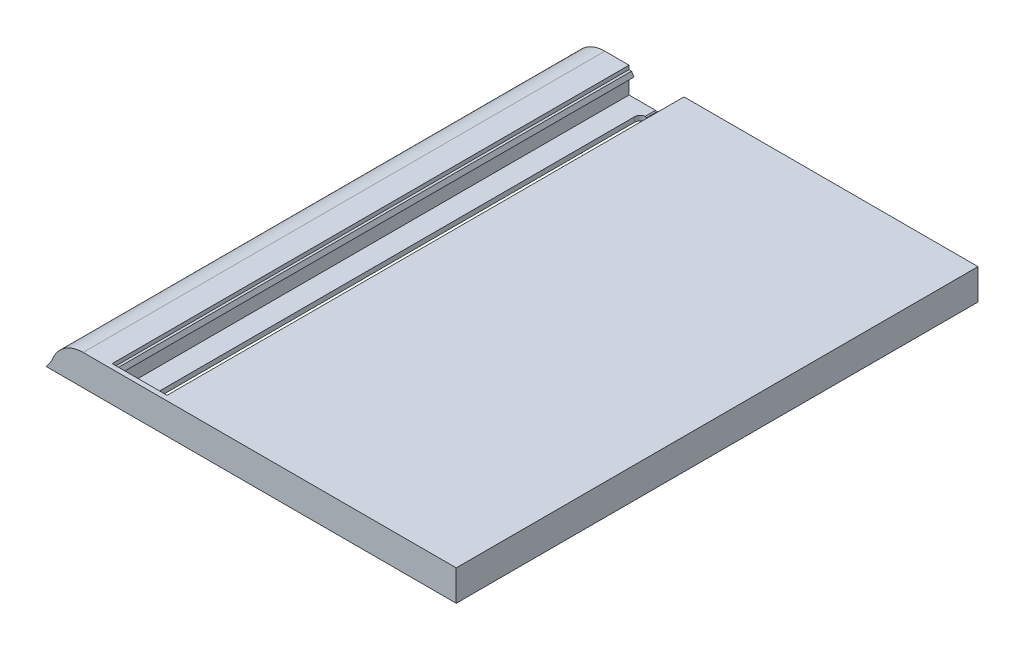
ISO-10303-21;
HEADER;
FILE_DESCRIPTION(('STEP AP214'),'2;1');
FILE_NAME('part.step','',(''),(''),'','','');
FILE_SCHEMA(('AUTOMOTIVE_DESIGN { 1 0 10303 214 1 1 1 1 }'));
ENDSEC;
DATA;
#1=APPLICATION_CONTEXT('core data for automotive mechanical design processes');
#2=APPLICATION_PROTOCOL_DEFINITION('international standard','automotive_design',2000,#1);
#3=PRODUCT_CONTEXT('',#1,'mechanical');
#4=PRODUCT('Part','Part','',(#3));
#5=PRODUCT_RELATED_PRODUCT_CATEGORY('part','',(#4));
#6=PRODUCT_DEFINITION_FORMATION('','',#4);
#7=PRODUCT_DEFINITION_CONTEXT('part definition',#1,'design');
#8=PRODUCT_DEFINITION('design','',#6,#7);
#9=PRODUCT_DEFINITION_SHAPE('','',#8);
#10=(LENGTH_UNIT() NAMED_UNIT(*) SI_UNIT(.MILLI.,.METRE.));
#11=(NAMED_UNIT(*) PLANE_ANGLE_UNIT() SI_UNIT($,.RADIAN.));
#12=(NAMED_UNIT(*) SI_UNIT($,.STERADIAN.) SOLID_ANGLE_UNIT());
#13=UNCERTAINTY_MEASURE_WITH_UNIT(LENGTH_MEASURE(1.E-05),#10,'distance_accuracy_value','');
#14=(GEOMETRIC_REPRESENTATION_CONTEXT(3) GLOBAL_UNCERTAINTY_ASSIGNED_CONTEXT((#13)) GLOBAL_UNIT_ASSIGNED_CONTEXT((#10,
#11,#12)) REPRESENTATION_CONTEXT('',''));
#15=CARTESIAN_POINT('',(0.,0.,0.));
#16=DIRECTION('',(0.,0.,1.));
#17=DIRECTION('',(1.,0.,0.));
#18=AXIS2_PLACEMENT_3D('',#15,#16,#17);
#19=CARTESIAN_POINT('',(-66.6999999999992,102.,100.67082039325));
#20=DIRECTION('',(0.707106781186531,-0.707106781186564,0.));
#21=DIRECTION('',(0.707106781186564,0.707106781186531,0.));
#22=AXIS2_PLACEMENT_3D('',#19,#20,#21);
#23=PLANE('',#22);
#24=DIRECTION('',(0.,0.,-1.));
#25=VECTOR('',#24,1.);
#26=CARTESIAN_POINT('',(-66.9999999999992,101.7,100.67082039325));
#27=LINE('',#26,#25);
#28=CARTESIAN_POINT('',(-66.9999999999992,101.7,-56.8249999999984));
#29=VERTEX_POINT('',#28);
#30=CARTESIAN_POINT('',(-66.9999999999992,101.7,-59.9999999999999));
#31=VERTEX_POINT('',#30);
#32=EDGE_CURVE('E401',#29,#31,#27,.T.);
#33=ORIENTED_EDGE('',*,*,#32,.F.);
#34=CARTESIAN_POINT('',(-67.0000000000015,101.699999999997,-55.));
#35=DIRECTION('',(0.707106781186531,-0.707106781186564,0.));
#36=DIRECTION('',(0.707106781186564,0.707106781186531,0.));
#37=AXIS2_PLACEMENT_3D('',#34,#35,#36);
#38=ELLIPSE('',#37,2.5809397513287,1.82499999999849);
#39=CARTESIAN_POINT('',(-66.6999999999992,102.,-56.8001736027375));
#40=VERTEX_POINT('',#39);
#41=EDGE_CURVE('E294',#29,#40,#38,.T.);
#42=ORIENTED_EDGE('',*,*,#41,.T.);
#43=DIRECTION('',(0.,0.,-1.));
#44=VECTOR('',#43,1.);
#45=CARTESIAN_POINT('',(-66.6999999999992,102.,100.67082039325));
#46=LINE('',#45,#44);
#47=CARTESIAN_POINT('',(-66.6999999999992,102.,-59.9999999999999));
#48=VERTEX_POINT('',#47);
#49=EDGE_CURVE('E408',#40,#48,#46,.T.);
#50=ORIENTED_EDGE('',*,*,#49,.T.);
#51=DIRECTION('',(-0.707106781186564,-0.707106781186531,0.));
#52=VECTOR('',#51,1.);
#53=CARTESIAN_POINT('',(-84.3499999999979,84.3500000000017,-60.));
#54=LINE('',#53,#52);
#55=EDGE_CURVE('E417',#48,#31,#54,.T.);
#56=ORIENTED_EDGE('',*,*,#55,.T.);
#57=EDGE_LOOP('',(#33,#42,#50,#56));
#58=FACE_BOUND('',#57,.T.);
#59=ADVANCED_FACE('F33',(#58),#23,.F.);
#60=CARTESIAN_POINT('',(-66.9999999999992,101.7,100.67082039325));
#61=DIRECTION('',(-0.707106781186531,-0.707106781186564,0.));
#62=DIRECTION('',(0.707106781186564,-0.707106781186531,0.));
#63=AXIS2_PLACEMENT_3D('',#60,#61,#62);
#64=PLANE('',#63);
#65=DIRECTION('',(0.,0.,-1.));
#66=VECTOR('',#65,1.);
#67=CARTESIAN_POINT('',(-67.2999999999992,102.,100.67082039325));
#68=LINE('',#67,#66);
#69=CARTESIAN_POINT('',(-67.2999999999992,102.,-56.8001736027382));
#70=VERTEX_POINT('',#69);
#71=CARTESIAN_POINT('',(-67.2999999999995,102.,-60.));
#72=VERTEX_POINT('',#71);
#73=EDGE_CURVE('E405',#70,#72,#68,.T.);
#74=ORIENTED_EDGE('',*,*,#73,.F.);
#75=CARTESIAN_POINT('',(-67.0000000000015,101.700000000002,-55.));
#76=DIRECTION('',(-0.707106781186531,-0.707106781186564,0.));
#77=DIRECTION('',(-0.707106781186564,0.707106781186531,0.));
#78=AXIS2_PLACEMENT_3D('',#75,#76,#77);
#79=ELLIPSE('',#78,2.58093975132872,1.82499999999849);
#80=EDGE_CURVE('E523',#70,#29,#79,.T.);
#81=ORIENTED_EDGE('',*,*,#80,.T.);
#82=ORIENTED_EDGE('',*,*,#32,.T.);
#83=DIRECTION('',(-0.707106781186564,0.707106781186531,0.));
#84=VECTOR('',#83,1.);
#85=CARTESIAN_POINT('',(17.3500000000018,17.3500000000026,-60.));
#86=LINE('',#85,#84);
#87=EDGE_CURVE('E414',#31,#72,#86,.T.);
#88=ORIENTED_EDGE('',*,*,#87,.T.);
#89=EDGE_LOOP('',(#74,#81,#82,#88));
#90=FACE_BOUND('',#89,.T.);
#91=ADVANCED_FACE('F553',(#90),#64,.F.);
#92=CARTESIAN_POINT('',(31.,102.,80.));
#93=DIRECTION('',(0.,1.,0.));
#94=DIRECTION('',(0.,0.,1.));
#95=AXIS2_PLACEMENT_3D('',#92,#93,#94);
#96=PLANE('',#95);
#97=CARTESIAN_POINT('',(-67.0000000000015,102.,-55.));
#98=DIRECTION('',(0.,1.,0.));
#99=DIRECTION('',(0.,0.,1.));
#100=AXIS2_PLACEMENT_3D('',#97,#98,#99);
#101=CIRCLE('',#100,1.82499999999849);
#102=CARTESIAN_POINT('',(-65.1750000000015,102.,-55.));
#103=VERTEX_POINT('',#102);
#104=EDGE_CURVE('E299',#103,#40,#101,.T.);
#105=ORIENTED_EDGE('',*,*,#104,.F.);
#106=DIRECTION('',(1.12502599828685E-13,0.,-1.));
#107=VECTOR('',#106,1.);
#108=CARTESIAN_POINT('',(-65.1750000000167,102.,79.9999999999892));
#109=LINE('',#108,#107);
#110=CARTESIAN_POINT('',(-65.1750000000184,102.,94.9999999999969));
#111=VERTEX_POINT('',#110);
#112=EDGE_CURVE('E270',#111,#103,#109,.T.);
#113=ORIENTED_EDGE('',*,*,#112,.F.);
#114=CARTESIAN_POINT('',(-67.0000000000015,102.,95.));
#115=DIRECTION('',(0.,1.,0.));
#116=DIRECTION('',(0.,0.,1.));
#117=AXIS2_PLACEMENT_3D('',#114,#115,#116);
#118=CIRCLE('',#117,1.82499999999999);
#119=CARTESIAN_POINT('',(-66.6999999999992,102.,96.8001736027391));
#120=VERTEX_POINT('',#119);
#121=EDGE_CURVE('E284',#120,#111,#118,.T.);
#122=ORIENTED_EDGE('',*,*,#121,.F.);
#123=CARTESIAN_POINT('',(-66.6999999999992,102.,100.));
#124=VERTEX_POINT('',#123);
#125=EDGE_CURVE('E411',#124,#120,#46,.T.);
#126=ORIENTED_EDGE('',*,*,#125,.F.);
#127=DIRECTION('',(-1.,0.,0.));
#128=VECTOR('',#127,1.);
#129=CARTESIAN_POINT('',(31.,102.,100.));
#130=LINE('',#129,#128);
#131=CARTESIAN_POINT('',(-58.4999999999992,102.,100.));
#132=VERTEX_POINT('',#131);
#133=EDGE_CURVE('E465',#132,#124,#130,.T.);
#134=ORIENTED_EDGE('',*,*,#133,.F.);
#135=DIRECTION('',(0.,0.,-1.));
#136=VECTOR('',#135,1.);
#137=CARTESIAN_POINT('',(-58.4999999999992,102.,121.691011963485));
#138=LINE('',#137,#136);
#139=CARTESIAN_POINT('',(-58.4999999999992,102.,-60.));
#140=VERTEX_POINT('',#139);
#141=EDGE_CURVE('E341',#132,#140,#138,.T.);
#142=ORIENTED_EDGE('',*,*,#141,.T.);
#143=DIRECTION('',(-1.,0.,0.));
#144=VECTOR('',#143,1.);
#145=CARTESIAN_POINT('',(31.,102.,-60.));
#146=LINE('',#145,#144);
#147=EDGE_CURVE('E424',#140,#48,#146,.T.);
#148=ORIENTED_EDGE('',*,*,#147,.T.);
#149=ORIENTED_EDGE('',*,*,#49,.F.);
#150=EDGE_LOOP('',(#105,#113,#122,#126,#134,#142,#148,#149));
#151=FACE_BOUND('',#150,.T.);
#152=ADVANCED_FACE('F544',(#151),#96,.T.);
#153=CARTESIAN_POINT('',(-101.758107565017,107.555793957317,100.));
#154=DIRECTION('',(0.,0.,-1.));
#155=DIRECTION('',(-1.,0.,0.));
#156=AXIS2_PLACEMENT_3D('',#153,#154,#155);
#157=PLANE('',#156);
#158=DIRECTION('',(-0.5,-0.866025403784439,0.));
#159=VECTOR('',#158,1.);
#160=CARTESIAN_POINT('',(-59.2783121635121,108.8,100.));
#161=LINE('',#160,#159);
#162=CARTESIAN_POINT('',(-59.2783121635121,108.8,100.));
#163=VERTEX_POINT('',#162);
#164=CARTESIAN_POINT('',(-59.9999999999991,107.55,100.));
#165=VERTEX_POINT('',#164);
#166=EDGE_CURVE('E381',#163,#165,#161,.T.);
#167=ORIENTED_EDGE('',*,*,#166,.T.);
#168=DIRECTION('',(1.,0.,0.));
#169=VECTOR('',#168,1.);
#170=CARTESIAN_POINT('',(-58.4999999999991,107.55,100.));
#171=LINE('',#170,#169);
#172=CARTESIAN_POINT('',(-58.4999999999991,107.55,100.));
#173=VERTEX_POINT('',#172);
#174=EDGE_CURVE('E316',#165,#173,#171,.T.);
#175=ORIENTED_EDGE('',*,*,#174,.T.);
#176=DIRECTION('',(0.,-1.,0.));
#177=VECTOR('',#176,1.);
#178=CARTESIAN_POINT('',(-58.4999999999992,102.,100.));
#179=LINE('',#178,#177);
#180=EDGE_CURVE('E314',#173,#132,#179,.T.);
#181=ORIENTED_EDGE('',*,*,#180,.T.);
#182=ORIENTED_EDGE('',*,*,#133,.T.);
#183=DIRECTION('',(-0.707106781186564,-0.707106781186531,0.));
#184=VECTOR('',#183,1.);
#185=CARTESIAN_POINT('',(-66.6999999999992,102.,100.));
#186=LINE('',#185,#184);
#187=CARTESIAN_POINT('',(-66.9999999999992,101.7,100.));
#188=VERTEX_POINT('',#187);
#189=EDGE_CURVE('E398',#124,#188,#186,.T.);
#190=ORIENTED_EDGE('',*,*,#189,.T.);
#191=DIRECTION('',(-0.707106781186564,0.707106781186531,0.));
#192=VECTOR('',#191,1.);
#193=CARTESIAN_POINT('',(-66.9999999999992,101.7,100.));
#194=LINE('',#193,#192);
#195=CARTESIAN_POINT('',(-67.2999999999992,102.,100.));
#196=VERTEX_POINT('',#195);
#197=EDGE_CURVE('E402',#188,#196,#194,.T.);
#198=ORIENTED_EDGE('',*,*,#197,.T.);
#199=CARTESIAN_POINT('',(-75.4999999999991,102.,100.));
#200=VERTEX_POINT('',#199);
#201=EDGE_CURVE('E466',#196,#200,#130,.T.);
#202=ORIENTED_EDGE('',*,*,#201,.T.);
#203=DIRECTION('',(0.,1.,0.));
#204=VECTOR('',#203,1.);
#205=CARTESIAN_POINT('',(-75.4999999999991,107.55,100.));
#206=LINE('',#205,#204);
#207=CARTESIAN_POINT('',(-75.4999999999991,107.55,100.));
#208=VERTEX_POINT('',#207);
#209=EDGE_CURVE('E312',#200,#208,#206,.T.);
#210=ORIENTED_EDGE('',*,*,#209,.T.);
#211=DIRECTION('',(1.,0.,0.));
#212=VECTOR('',#211,1.);
#213=CARTESIAN_POINT('',(-73.9999999999991,107.55,100.));
#214=LINE('',#213,#212);
#215=CARTESIAN_POINT('',(-73.9999999999991,107.55,100.));
#216=VERTEX_POINT('',#215);
#217=EDGE_CURVE('E309',#208,#216,#214,.T.);
#218=ORIENTED_EDGE('',*,*,#217,.T.);
#219=DIRECTION('',(-0.499999999999998,0.86602540378444,0.));
#220=VECTOR('',#219,1.);
#221=CARTESIAN_POINT('',(-73.5669872981068,106.8,100.));
#222=LINE('',#221,#220);
#223=CARTESIAN_POINT('',(-74.7216878364861,108.8,100.));
#224=VERTEX_POINT('',#223);
#225=EDGE_CURVE('E379',#216,#224,#222,.T.);
#226=ORIENTED_EDGE('',*,*,#225,.T.);
#227=DIRECTION('',(-1.,0.,0.));
#228=VECTOR('',#227,1.);
#229=CARTESIAN_POINT('',(-74.7216878364861,108.8,100.));
#230=LINE('',#229,#228);
#231=CARTESIAN_POINT('',(-75.4999999999991,108.8,100.));
#232=VERTEX_POINT('',#231);
#233=EDGE_CURVE('E375',#224,#232,#230,.T.);
#234=ORIENTED_EDGE('',*,*,#233,.T.);
#235=DIRECTION('',(0.,1.,0.));
#236=VECTOR('',#235,1.);
#237=CARTESIAN_POINT('',(-75.4999999999991,110.,100.));
#238=LINE('',#237,#236);
#239=CARTESIAN_POINT('',(-75.4999999999991,110.,100.));
#240=VERTEX_POINT('',#239);
#241=EDGE_CURVE('E371',#232,#240,#238,.T.);
#242=ORIENTED_EDGE('',*,*,#241,.T.);
#243=DIRECTION('',(1.,0.,0.));
#244=VECTOR('',#243,1.);
#245=CARTESIAN_POINT('',(-58.4999999999991,110.,100.));
#246=LINE('',#245,#244);
#247=CARTESIAN_POINT('',(-58.4999999999991,110.,100.));
#248=VERTEX_POINT('',#247);
#249=EDGE_CURVE('E367',#240,#248,#246,.T.);
#250=ORIENTED_EDGE('',*,*,#249,.T.);
#251=DIRECTION('',(0.,-1.,0.));
#252=VECTOR('',#251,1.);
#253=CARTESIAN_POINT('',(-58.4999999999991,110.,100.));
#254=LINE('',#253,#252);
#255=CARTESIAN_POINT('',(-58.4999999999991,108.8,100.));
#256=VERTEX_POINT('',#255);
#257=EDGE_CURVE('E362',#248,#256,#254,.T.);
#258=ORIENTED_EDGE('',*,*,#257,.T.);
#259=DIRECTION('',(-1.,-2.13967430422916E-13,0.));
#260=VECTOR('',#259,1.);
#261=CARTESIAN_POINT('',(-58.4999999999991,108.8,100.));
#262=LINE('',#261,#260);
#263=EDGE_CURVE('E358',#256,#163,#262,.T.);
#264=ORIENTED_EDGE('',*,*,#263,.T.);
#265=EDGE_LOOP('',(#167,#175,#181,#182,#190,#198,#202,#210,#218,#226,#234,#242,#250,#258,#264));
#266=FACE_BOUND('',#265,.T.);
#267=ADVANCED_FACE('F570',(#266),#157,.T.);
#268=DIRECTION('',(0.,-1.,0.));
#269=VECTOR('',#268,1.);
#270=CARTESIAN_POINT('',(-76.7499999999992,100.5,100.));
#271=LINE('',#270,#269);
#272=CARTESIAN_POINT('',(-76.75,108.5,100.));
#273=VERTEX_POINT('',#272);
#274=CARTESIAN_POINT('',(-76.75,102.,100.));
#275=VERTEX_POINT('',#274);
#276=EDGE_CURVE('E306',#273,#275,#271,.T.);
#277=ORIENTED_EDGE('',*,*,#276,.T.);
#278=CARTESIAN_POINT('',(-91.5328115921767,102.,100.));
#279=VERTEX_POINT('',#278);
#280=EDGE_CURVE('E461',#275,#279,#130,.T.);
#281=ORIENTED_EDGE('',*,*,#280,.T.);
#282=CARTESIAN_POINT('',(-101.758107565017,107.555793957317,100.));
#283=DIRECTION('',(0.,0.,1.));
#284=DIRECTION('',(-1.,0.,0.));
#285=AXIS2_PLACEMENT_3D('',#282,#283,#284);
#286=CIRCLE('',#285,11.6371613475259);
#287=CARTESIAN_POINT('',(-90.9912312756488,103.14015139957,100.));
#288=VERTEX_POINT('',#287);
#289=EDGE_CURVE('E464',#279,#288,#286,.T.);
#290=ORIENTED_EDGE('',*,*,#289,.T.);
#291=CARTESIAN_POINT('',(-83.,99.8628386524749,100.));
#292=DIRECTION('',(0.,0.,-1.));
#293=DIRECTION('',(-1.,0.,0.));
#294=AXIS2_PLACEMENT_3D('',#291,#292,#293);
#295=CIRCLE('',#294,8.63716134752511);
#296=CARTESIAN_POINT('',(-83.,108.5,100.));
#297=VERTEX_POINT('',#296);
#298=EDGE_CURVE('E451',#288,#297,#295,.T.);
#299=ORIENTED_EDGE('',*,*,#298,.T.);
#300=DIRECTION('',(1.,0.,0.));
#301=VECTOR('',#300,1.);
#302=CARTESIAN_POINT('',(-83.,108.5,100.));
#303=LINE('',#302,#301);
#304=EDGE_CURVE('E455',#297,#273,#303,.T.);
#305=ORIENTED_EDGE('',*,*,#304,.T.);
#306=EDGE_LOOP('',(#277,#281,#290,#299,#305));
#307=FACE_BOUND('',#306,.T.);
#308=ADVANCED_FACE('F574',(#307),#157,.T.);
#309=CARTESIAN_POINT('',(-67.0000000000015,102.,-55.));
#310=DIRECTION('',(0.,1.,0.));
#311=DIRECTION('',(0.,0.,1.));
#312=AXIS2_PLACEMENT_3D('',#309,#310,#311);
#313=CIRCLE('',#312,1.82499999999849);
#314=CARTESIAN_POINT('',(-68.8249999999985,102.,-55.));
#315=VERTEX_POINT('',#314);
#316=EDGE_CURVE('E297',#70,#315,#313,.T.);
#317=ORIENTED_EDGE('',*,*,#316,.F.);
#318=ORIENTED_EDGE('',*,*,#73,.T.);
#319=CARTESIAN_POINT('',(-75.4999999999991,102.,-60.));
#320=VERTEX_POINT('',#319);
#321=EDGE_CURVE('E425',#72,#320,#146,.T.);
#322=ORIENTED_EDGE('',*,*,#321,.T.);
#323=DIRECTION('',(0.,0.,-1.));
#324=VECTOR('',#323,1.);
#325=CARTESIAN_POINT('',(-75.4999999999992,102.,121.691011963485));
#326=LINE('',#325,#324);
#327=EDGE_CURVE('E343',#200,#320,#326,.T.);
#328=ORIENTED_EDGE('',*,*,#327,.F.);
#329=ORIENTED_EDGE('',*,*,#201,.F.);
#330=CARTESIAN_POINT('',(-67.2999999999992,102.,96.8001736027399));
#331=VERTEX_POINT('',#330);
#332=EDGE_CURVE('E283',#196,#331,#68,.T.);
#333=ORIENTED_EDGE('',*,*,#332,.T.);
#334=CARTESIAN_POINT('',(-67.0000000000015,102.,95.));
#335=DIRECTION('',(0.,1.,0.));
#336=DIRECTION('',(0.,0.,1.));
#337=AXIS2_PLACEMENT_3D('',#334,#335,#336);
#338=CIRCLE('',#337,1.82499999999999);
#339=CARTESIAN_POINT('',(-68.8250000000015,102.,94.9999999999967));
#340=VERTEX_POINT('',#339);
#341=EDGE_CURVE('E55',#340,#331,#338,.T.);
#342=ORIENTED_EDGE('',*,*,#341,.F.);
#343=DIRECTION('',(-1.32486614271938E-13,0.,1.));
#344=VECTOR('',#343,1.);
#345=CARTESIAN_POINT('',(-68.8250000000164,102.,79.9999999999868));
#346=LINE('',#345,#344);
#347=EDGE_CURVE('E264',#315,#340,#346,.T.);
#348=ORIENTED_EDGE('',*,*,#347,.F.);
#349=EDGE_LOOP('',(#317,#318,#322,#328,#329,#333,#342,#348));
#350=FACE_BOUND('',#349,.T.);
#351=ADVANCED_FACE('F281',(#350),#96,.T.);
#352=CARTESIAN_POINT('',(-83.,108.5,80.));
#353=DIRECTION('',(0.,-1.,0.));
#354=DIRECTION('',(0.,0.,-1.));
#355=AXIS2_PLACEMENT_3D('',#352,#353,#354);
#356=PLANE('',#355);
#357=DIRECTION('',(0.,0.,1.));
#358=VECTOR('',#357,1.);
#359=CARTESIAN_POINT('',(-57.2499999999999,108.5,80.));
#360=LINE('',#359,#358);
#361=CARTESIAN_POINT('',(-57.2499999999996,108.5,-60.));
#362=VERTEX_POINT('',#361);
#363=CARTESIAN_POINT('',(-57.2499999999996,108.5,100.));
#364=VERTEX_POINT('',#363);
#365=EDGE_CURVE('E355',#362,#364,#360,.T.);
#366=ORIENTED_EDGE('',*,*,#365,.F.);
#367=DIRECTION('',(1.,0.,0.));
#368=VECTOR('',#367,1.);
#369=CARTESIAN_POINT('',(-83.,108.5,-60.));
#370=LINE('',#369,#368);
#371=CARTESIAN_POINT('',(31.,108.5,-60.));
#372=VERTEX_POINT('',#371);
#373=EDGE_CURVE('E428',#362,#372,#370,.T.);
#374=ORIENTED_EDGE('',*,*,#373,.T.);
#375=DIRECTION('',(0.,0.,1.));
#376=VECTOR('',#375,1.);
#377=CARTESIAN_POINT('',(31.,108.5,80.));
#378=LINE('',#377,#376);
#379=CARTESIAN_POINT('',(31.,108.5,100.));
#380=VERTEX_POINT('',#379);
#381=EDGE_CURVE('E476',#372,#380,#378,.T.);
#382=ORIENTED_EDGE('',*,*,#381,.T.);
#383=EDGE_CURVE('E454',#364,#380,#303,.T.);
#384=ORIENTED_EDGE('',*,*,#383,.F.);
#385=EDGE_LOOP('',(#366,#374,#382,#384));
#386=FACE_BOUND('',#385,.T.);
#387=ADVANCED_FACE('F598',(#386),#356,.T.);
#388=DIRECTION('',(0.,0.,-1.));
#389=VECTOR('',#388,1.);
#390=CARTESIAN_POINT('',(-57.2499999999993,102.,80.));
#391=LINE('',#390,#389);
#392=CARTESIAN_POINT('',(-57.2499999999993,102.,100.));
#393=VERTEX_POINT('',#392);
#394=CARTESIAN_POINT('',(-57.2499999999996,102.,-60.));
#395=VERTEX_POINT('',#394);
#396=EDGE_CURVE('E352',#393,#395,#391,.T.);
#397=ORIENTED_EDGE('',*,*,#396,.F.);
#398=CARTESIAN_POINT('',(31.,102.,100.));
#399=VERTEX_POINT('',#398);
#400=EDGE_CURVE('E462',#399,#393,#130,.T.);
#401=ORIENTED_EDGE('',*,*,#400,.F.);
#402=DIRECTION('',(0.,0.,1.));
#403=VECTOR('',#402,1.);
#404=CARTESIAN_POINT('',(31.,102.,80.));
#405=LINE('',#404,#403);
#406=CARTESIAN_POINT('',(31.,102.,-60.));
#407=VERTEX_POINT('',#406);
#408=EDGE_CURVE('E474',#407,#399,#405,.T.);
#409=ORIENTED_EDGE('',*,*,#408,.F.);
#410=EDGE_CURVE('E421',#407,#395,#146,.T.);
#411=ORIENTED_EDGE('',*,*,#410,.T.);
#412=EDGE_LOOP('',(#397,#401,#409,#411));
#413=FACE_BOUND('',#412,.T.);
#414=ADVANCED_FACE('F609',(#413),#96,.T.);
#415=CARTESIAN_POINT('',(-101.758107565017,107.555793957317,101.5));
#416=DIRECTION('',(0.,0.,-1.));
#417=DIRECTION('',(-1.,0.,0.));
#418=AXIS2_PLACEMENT_3D('',#415,#416,#417);
#419=CYLINDRICAL_SURFACE('',#418,10.1371613475259);
#420=DIRECTION('',(0.,0.,-1.));
#421=VECTOR('',#420,1.);
#422=CARTESIAN_POINT('',(-92.3790537825084,103.709316304896,101.5));
#423=LINE('',#422,#421);
#424=CARTESIAN_POINT('',(-92.3790537825084,103.709316304896,101.5));
#425=VERTEX_POINT('',#424);
#426=CARTESIAN_POINT('',(-92.3790537825084,103.709316304896,-60.));
#427=VERTEX_POINT('',#426);
#428=EDGE_CURVE('E497',#425,#427,#423,.T.);
#429=ORIENTED_EDGE('',*,*,#428,.T.);
#430=CARTESIAN_POINT('',(-101.758107565017,107.555793957317,-60.));
#431=DIRECTION('',(0.,0.,-1.));
#432=DIRECTION('',(-1.,0.,0.));
#433=AXIS2_PLACEMENT_3D('',#430,#431,#432);
#434=CIRCLE('',#433,10.1371613475259);
#435=CARTESIAN_POINT('',(-94.4795217258819,100.5,-60.));
#436=VERTEX_POINT('',#435);
#437=EDGE_CURVE('E445',#436,#427,#434,.F.);
#438=ORIENTED_EDGE('',*,*,#437,.F.);
#439=DIRECTION('',(0.,0.,-1.));
#440=VECTOR('',#439,1.);
#441=CARTESIAN_POINT('',(-94.4795217258819,100.5,101.5));
#442=LINE('',#441,#440);
#443=CARTESIAN_POINT('',(-94.4795217258819,100.5,101.5));
#444=VERTEX_POINT('',#443);
#445=EDGE_CURVE('E498',#444,#436,#442,.T.);
#446=ORIENTED_EDGE('',*,*,#445,.F.);
#447=CARTESIAN_POINT('',(-101.758107565017,107.555793957317,101.5));
#448=DIRECTION('',(0.,0.,1.));
#449=DIRECTION('',(-1.,0.,0.));
#450=AXIS2_PLACEMENT_3D('',#447,#448,#449);
#451=CIRCLE('',#450,10.1371613475259);
#452=EDGE_CURVE('E482',#444,#425,#451,.T.);
#453=ORIENTED_EDGE('',*,*,#452,.T.);
#454=EDGE_LOOP('',(#429,#438,#446,#453));
#455=FACE_BOUND('',#454,.T.);
#456=ADVANCED_FACE('F35',(#455),#419,.F.);
#457=CARTESIAN_POINT('',(-94.4795217258819,100.5,101.5));
#458=DIRECTION('',(0.,-1.,0.));
#459=DIRECTION('',(1.,0.,0.));
#460=AXIS2_PLACEMENT_3D('',#457,#458,#459);
#461=PLANE('',#460);
#462=CARTESIAN_POINT('',(-67.0000000000015,100.5,-55.));
#463=DIRECTION('',(0.,-1.,0.));
#464=DIRECTION('',(1.,0.,0.));
#465=AXIS2_PLACEMENT_3D('',#462,#463,#464);
#466=CIRCLE('',#465,1.82499999999849);
#467=CARTESIAN_POINT('',(-68.8249999999985,100.5,-55.));
#468=VERTEX_POINT('',#467);
#469=CARTESIAN_POINT('',(-65.1750000000015,100.5,-55.));
#470=VERTEX_POINT('',#469);
#471=EDGE_CURVE('E271',#468,#470,#466,.T.);
#472=ORIENTED_EDGE('',*,*,#471,.F.);
#473=DIRECTION('',(1.32486614271938E-13,0.,-1.));
#474=VECTOR('',#473,1.);
#475=CARTESIAN_POINT('',(-68.8250000000192,100.5,101.500000000003));
#476=LINE('',#475,#474);
#477=CARTESIAN_POINT('',(-68.8250000000184,100.5,94.9999999999967));
#478=VERTEX_POINT('',#477);
#479=EDGE_CURVE('E41',#478,#468,#476,.T.);
#480=ORIENTED_EDGE('',*,*,#479,.F.);
#481=CARTESIAN_POINT('',(-67.0000000000015,100.5,95.));
#482=DIRECTION('',(0.,-1.,0.));
#483=DIRECTION('',(1.,0.,0.));
#484=AXIS2_PLACEMENT_3D('',#481,#482,#483);
#485=CIRCLE('',#484,1.82499999999999);
#486=CARTESIAN_POINT('',(-65.1750000000184,100.5,94.9999999999969));
#487=VERTEX_POINT('',#486);
#488=EDGE_CURVE('E276',#487,#478,#485,.T.);
#489=ORIENTED_EDGE('',*,*,#488,.F.);
#490=DIRECTION('',(-1.12502599828685E-13,0.,1.));
#491=VECTOR('',#490,1.);
#492=CARTESIAN_POINT('',(-65.1750000000191,100.5,101.500000000003));
#493=LINE('',#492,#491);
#494=EDGE_CURVE('E11',#470,#487,#493,.T.);
#495=ORIENTED_EDGE('',*,*,#494,.F.);
#496=EDGE_LOOP('',(#472,#480,#489,#495));
#497=FACE_BOUND('',#496,.T.);
#498=ORIENTED_EDGE('',*,*,#445,.T.);
#499=DIRECTION('',(-1.,0.,0.));
#500=VECTOR('',#499,1.);
#501=CARTESIAN_POINT('',(32.5,100.5,-60.));
#502=LINE('',#501,#500);
#503=CARTESIAN_POINT('',(32.5,100.5,-60.));
#504=VERTEX_POINT('',#503);
#505=EDGE_CURVE('E434',#504,#436,#502,.T.);
#506=ORIENTED_EDGE('',*,*,#505,.F.);
#507=DIRECTION('',(0.,0.,-1.));
#508=VECTOR('',#507,1.);
#509=CARTESIAN_POINT('',(32.5,100.5,101.5));
#510=LINE('',#509,#508);
#511=CARTESIAN_POINT('',(32.5,100.5,101.5));
#512=VERTEX_POINT('',#511);
#513=EDGE_CURVE('E502',#512,#504,#510,.T.);
#514=ORIENTED_EDGE('',*,*,#513,.F.);
#515=DIRECTION('',(-1.,0.,0.));
#516=VECTOR('',#515,1.);
#517=CARTESIAN_POINT('',(-94.4795217258819,100.5,101.5));
#518=LINE('',#517,#516);
#519=EDGE_CURVE('E494',#512,#444,#518,.T.);
#520=ORIENTED_EDGE('',*,*,#519,.T.);
#521=EDGE_LOOP('',(#498,#506,#514,#520));
#522=FACE_BOUND('',#521,.T.);
#523=ADVANCED_FACE('F532',(#497,#522),#461,.T.);
#524=CARTESIAN_POINT('',(32.5,100.5,101.5));
#525=DIRECTION('',(1.,0.,0.));
#526=DIRECTION('',(0.,0.,-1.));
#527=AXIS2_PLACEMENT_3D('',#524,#525,#526);
#528=PLANE('',#527);
#529=ORIENTED_EDGE('',*,*,#513,.T.);
#530=DIRECTION('',(0.,-1.,0.));
#531=VECTOR('',#530,1.);
#532=CARTESIAN_POINT('',(32.5,110.,-60.));
#533=LINE('',#532,#531);
#534=CARTESIAN_POINT('',(32.5,110.,-60.));
#535=VERTEX_POINT('',#534);
#536=EDGE_CURVE('E436',#535,#504,#533,.T.);
#537=ORIENTED_EDGE('',*,*,#536,.F.);
#538=DIRECTION('',(0.,0.,-1.));
#539=VECTOR('',#538,1.);
#540=CARTESIAN_POINT('',(32.5,110.,101.5));
#541=LINE('',#540,#539);
#542=CARTESIAN_POINT('',(32.5,110.,101.5));
#543=VERTEX_POINT('',#542);
#544=EDGE_CURVE('E504',#543,#535,#541,.T.);
#545=ORIENTED_EDGE('',*,*,#544,.F.);
#546=DIRECTION('',(0.,-1.,0.));
#547=VECTOR('',#546,1.);
#548=CARTESIAN_POINT('',(32.5,100.5,101.5));
#549=LINE('',#548,#547);
#550=EDGE_CURVE('E491',#543,#512,#549,.T.);
#551=ORIENTED_EDGE('',*,*,#550,.T.);
#552=EDGE_LOOP('',(#529,#537,#545,#551));
#553=FACE_BOUND('',#552,.T.);
#554=ADVANCED_FACE('F666',(#553),#528,.T.);
#555=CARTESIAN_POINT('',(-83.,110.,101.5));
#556=DIRECTION('',(0.,1.,0.));
#557=DIRECTION('',(0.,0.,1.));
#558=AXIS2_PLACEMENT_3D('',#555,#556,#557);
#559=PLANE('',#558);
#560=ORIENTED_EDGE('',*,*,#544,.T.);
#561=DIRECTION('',(1.,0.,0.));
#562=VECTOR('',#561,1.);
#563=CARTESIAN_POINT('',(-83.,110.,-60.));
#564=LINE('',#563,#562);
#565=CARTESIAN_POINT('',(-58.4999999999991,110.,-60.));
#566=VERTEX_POINT('',#565);
#567=EDGE_CURVE('E439',#566,#535,#564,.T.);
#568=ORIENTED_EDGE('',*,*,#567,.F.);
#569=DIRECTION('',(0.,0.,-1.));
#570=VECTOR('',#569,1.);
#571=CARTESIAN_POINT('',(-58.4999999999991,110.,117.298554852935));
#572=LINE('',#571,#570);
#573=EDGE_CURVE('E366',#248,#566,#572,.T.);
#574=ORIENTED_EDGE('',*,*,#573,.F.);
#575=ORIENTED_EDGE('',*,*,#249,.F.);
#576=DIRECTION('',(0.,0.,-1.));
#577=VECTOR('',#576,1.);
#578=CARTESIAN_POINT('',(-75.4999999999991,110.,117.298554852935));
#579=LINE('',#578,#577);
#580=CARTESIAN_POINT('',(-75.4999999999991,110.,-60.));
#581=VERTEX_POINT('',#580);
#582=EDGE_CURVE('E370',#240,#581,#579,.T.);
#583=ORIENTED_EDGE('',*,*,#582,.T.);
#584=CARTESIAN_POINT('',(-83.,110.,-60.));
#585=VERTEX_POINT('',#584);
#586=EDGE_CURVE('E440',#585,#581,#564,.T.);
#587=ORIENTED_EDGE('',*,*,#586,.F.);
#588=DIRECTION('',(0.,0.,-1.));
#589=VECTOR('',#588,1.);
#590=CARTESIAN_POINT('',(-83.,110.,101.5));
#591=LINE('',#590,#589);
#592=CARTESIAN_POINT('',(-83.,110.,101.5));
#593=VERTEX_POINT('',#592);
#594=EDGE_CURVE('E507',#593,#585,#591,.T.);
#595=ORIENTED_EDGE('',*,*,#594,.F.);
#596=DIRECTION('',(1.,0.,0.));
#597=VECTOR('',#596,1.);
#598=CARTESIAN_POINT('',(-83.,110.,101.5));
#599=LINE('',#598,#597);
#600=EDGE_CURVE('E488',#593,#543,#599,.T.);
#601=ORIENTED_EDGE('',*,*,#600,.T.);
#602=EDGE_LOOP('',(#560,#568,#574,#575,#583,#587,#595,#601));
#603=FACE_BOUND('',#602,.T.);
#604=ADVANCED_FACE('F669',(#603),#559,.T.);
#605=CARTESIAN_POINT('',(-83.,99.8628386524749,101.5));
#606=DIRECTION('',(0.,0.,-1.));
#607=DIRECTION('',(-1.,0.,0.));
#608=AXIS2_PLACEMENT_3D('',#605,#606,#607);
#609=CYLINDRICAL_SURFACE('',#608,10.1371613475251);
#610=ORIENTED_EDGE('',*,*,#594,.T.);
#611=CARTESIAN_POINT('',(-83.,99.8628386524749,-60.));
#612=DIRECTION('',(0.,0.,-1.));
#613=DIRECTION('',(-1.,0.,0.));
#614=AXIS2_PLACEMENT_3D('',#611,#612,#613);
#615=CIRCLE('',#614,10.1371613475251);
#616=EDGE_CURVE('E442',#427,#585,#615,.T.);
#617=ORIENTED_EDGE('',*,*,#616,.F.);
#618=ORIENTED_EDGE('',*,*,#428,.F.);
#619=CARTESIAN_POINT('',(-83.,99.8628386524749,101.5));
#620=DIRECTION('',(0.,0.,-1.));
#621=DIRECTION('',(-1.,0.,0.));
#622=AXIS2_PLACEMENT_3D('',#619,#620,#621);
#623=CIRCLE('',#622,10.1371613475251);
#624=EDGE_CURVE('E485',#425,#593,#623,.T.);
#625=ORIENTED_EDGE('',*,*,#624,.T.);
#626=EDGE_LOOP('',(#610,#617,#618,#625));
#627=FACE_BOUND('',#626,.T.);
#628=ADVANCED_FACE('F672',(#627),#609,.T.);
#629=CARTESIAN_POINT('',(-101.758107565017,107.555793957317,101.5));
#630=DIRECTION('',(0.,0.,-1.));
#631=DIRECTION('',(-1.,0.,0.));
#632=AXIS2_PLACEMENT_3D('',#629,#630,#631);
#633=PLANE('',#632);
#634=ORIENTED_EDGE('',*,*,#452,.F.);
#635=ORIENTED_EDGE('',*,*,#519,.F.);
#636=ORIENTED_EDGE('',*,*,#550,.F.);
#637=ORIENTED_EDGE('',*,*,#600,.F.);
#638=ORIENTED_EDGE('',*,*,#624,.F.);
#639=EDGE_LOOP('',(#634,#635,#636,#637,#638));
#640=FACE_BOUND('',#639,.T.);
#641=ADVANCED_FACE('F621',(#640),#633,.F.);
#642=CARTESIAN_POINT('',(0.,0.,-60.));
#643=DIRECTION('',(0.,0.,-1.));
#644=DIRECTION('',(-1.,0.,0.));
#645=AXIS2_PLACEMENT_3D('',#642,#643,#644);
#646=PLANE('',#645);
#647=ORIENTED_EDGE('',*,*,#373,.F.);
#648=DIRECTION('',(0.,-1.,0.));
#649=VECTOR('',#648,1.);
#650=CARTESIAN_POINT('',(-57.25,110.,-60.));
#651=LINE('',#650,#649);
#652=EDGE_CURVE('E303',#362,#395,#651,.T.);
#653=ORIENTED_EDGE('',*,*,#652,.T.);
#654=ORIENTED_EDGE('',*,*,#410,.F.);
#655=DIRECTION('',(0.,-1.,0.));
#656=VECTOR('',#655,1.);
#657=CARTESIAN_POINT('',(31.,108.5,-60.));
#658=LINE('',#657,#656);
#659=EDGE_CURVE('E423',#372,#407,#658,.T.);
#660=ORIENTED_EDGE('',*,*,#659,.F.);
#661=EDGE_LOOP('',(#647,#653,#654,#660));
#662=FACE_BOUND('',#661,.T.);
#663=CARTESIAN_POINT('',(-76.75,102.,-60.));
#664=VERTEX_POINT('',#663);
#665=CARTESIAN_POINT('',(-91.5328115921767,102.,-60.));
#666=VERTEX_POINT('',#665);
#667=EDGE_CURVE('E420',#664,#666,#146,.T.);
#668=ORIENTED_EDGE('',*,*,#667,.F.);
#669=DIRECTION('',(0.,1.,0.));
#670=VECTOR('',#669,1.);
#671=CARTESIAN_POINT('',(-76.7499999999992,100.5,-60.));
#672=LINE('',#671,#670);
#673=CARTESIAN_POINT('',(-76.75,108.5,-60.));
#674=VERTEX_POINT('',#673);
#675=EDGE_CURVE('E321',#664,#674,#672,.T.);
#676=ORIENTED_EDGE('',*,*,#675,.T.);
#677=CARTESIAN_POINT('',(-83.,108.5,-60.));
#678=VERTEX_POINT('',#677);
#679=EDGE_CURVE('E429',#678,#674,#370,.T.);
#680=ORIENTED_EDGE('',*,*,#679,.F.);
#681=CARTESIAN_POINT('',(-83.,99.8628386524749,-60.));
#682=DIRECTION('',(0.,0.,-1.));
#683=DIRECTION('',(-1.,0.,0.));
#684=AXIS2_PLACEMENT_3D('',#681,#682,#683);
#685=CIRCLE('',#684,8.63716134752511);
#686=CARTESIAN_POINT('',(-90.9912312756488,103.14015139957,-60.));
#687=VERTEX_POINT('',#686);
#688=EDGE_CURVE('E431',#687,#678,#685,.T.);
#689=ORIENTED_EDGE('',*,*,#688,.F.);
#690=CARTESIAN_POINT('',(-101.758107565017,107.555793957317,-60.));
#691=DIRECTION('',(0.,0.,-1.));
#692=DIRECTION('',(-1.,0.,0.));
#693=AXIS2_PLACEMENT_3D('',#690,#691,#692);
#694=CIRCLE('',#693,11.6371613475259);
#695=EDGE_CURVE('E448',#666,#687,#694,.F.);
#696=ORIENTED_EDGE('',*,*,#695,.F.);
#697=EDGE_LOOP('',(#668,#676,#680,#689,#696));
#698=FACE_BOUND('',#697,.T.);
#699=DIRECTION('',(-1.,0.,0.));
#700=VECTOR('',#699,1.);
#701=CARTESIAN_POINT('',(-58.4999999999991,107.55,-60.));
#702=LINE('',#701,#700);
#703=CARTESIAN_POINT('',(-58.4999999999991,107.55,-60.));
#704=VERTEX_POINT('',#703);
#705=CARTESIAN_POINT('',(-59.9999999999991,107.55,-60.));
#706=VERTEX_POINT('',#705);
#707=EDGE_CURVE('E333',#704,#706,#702,.T.);
#708=ORIENTED_EDGE('',*,*,#707,.T.);
#709=DIRECTION('',(-0.5,-0.866025403784439,0.));
#710=VECTOR('',#709,1.);
#711=CARTESIAN_POINT('',(-91.5705160885073,52.8682621135326,-60.));
#712=LINE('',#711,#710);
#713=CARTESIAN_POINT('',(-59.2783121635121,108.8,-60.));
#714=VERTEX_POINT('',#713);
#715=EDGE_CURVE('E396',#714,#706,#712,.T.);
#716=ORIENTED_EDGE('',*,*,#715,.F.);
#717=DIRECTION('',(-1.,-2.13967430422916E-13,0.));
#718=VECTOR('',#717,1.);
#719=CARTESIAN_POINT('',(-2.32796564300159E-11,108.800000000012,-60.));
#720=LINE('',#719,#718);
#721=CARTESIAN_POINT('',(-58.4999999999991,108.8,-60.));
#722=VERTEX_POINT('',#721);
#723=EDGE_CURVE('E511',#722,#714,#720,.T.);
#724=ORIENTED_EDGE('',*,*,#723,.F.);
#725=DIRECTION('',(0.,-1.,0.));
#726=VECTOR('',#725,1.);
#727=CARTESIAN_POINT('',(-58.4999999999991,0.,-60.));
#728=LINE('',#727,#726);
#729=EDGE_CURVE('E501',#566,#722,#728,.T.);
#730=ORIENTED_EDGE('',*,*,#729,.F.);
#731=ORIENTED_EDGE('',*,*,#567,.T.);
#732=ORIENTED_EDGE('',*,*,#536,.T.);
#733=ORIENTED_EDGE('',*,*,#505,.T.);
#734=ORIENTED_EDGE('',*,*,#437,.T.);
#735=ORIENTED_EDGE('',*,*,#616,.T.);
#736=ORIENTED_EDGE('',*,*,#586,.T.);
#737=DIRECTION('',(0.,1.,0.));
#738=VECTOR('',#737,1.);
#739=CARTESIAN_POINT('',(-75.4999999999991,0.,-60.));
#740=LINE('',#739,#738);
#741=CARTESIAN_POINT('',(-75.4999999999991,108.8,-60.));
#742=VERTEX_POINT('',#741);
#743=EDGE_CURVE('E513',#742,#581,#740,.T.);
#744=ORIENTED_EDGE('',*,*,#743,.F.);
#745=DIRECTION('',(-1.,0.,0.));
#746=VECTOR('',#745,1.);
#747=CARTESIAN_POINT('',(3.8799427383355E-12,108.799999999997,-60.));
#748=LINE('',#747,#746);
#749=CARTESIAN_POINT('',(-74.7216878364861,108.8,-60.));
#750=VERTEX_POINT('',#749);
#751=EDGE_CURVE('E516',#750,#742,#748,.T.);
#752=ORIENTED_EDGE('',*,*,#751,.F.);
#753=DIRECTION('',(-0.499999999999998,0.86602540378444,0.));
#754=VECTOR('',#753,1.);
#755=CARTESIAN_POINT('',(-8.92948391149149,-5.15543994002402,-60.));
#756=LINE('',#755,#754);
#757=CARTESIAN_POINT('',(-73.9999999999991,107.55,-60.));
#758=VERTEX_POINT('',#757);
#759=EDGE_CURVE('E394',#758,#750,#756,.T.);
#760=ORIENTED_EDGE('',*,*,#759,.F.);
#761=DIRECTION('',(-1.,0.,0.));
#762=VECTOR('',#761,1.);
#763=CARTESIAN_POINT('',(-73.9999999999991,107.55,-60.));
#764=LINE('',#763,#762);
#765=CARTESIAN_POINT('',(-75.4999999999991,107.55,-60.));
#766=VERTEX_POINT('',#765);
#767=EDGE_CURVE('E324',#758,#766,#764,.T.);
#768=ORIENTED_EDGE('',*,*,#767,.T.);
#769=DIRECTION('',(0.,-1.,0.));
#770=VECTOR('',#769,1.);
#771=CARTESIAN_POINT('',(-75.4999999999991,107.55,-60.));
#772=LINE('',#771,#770);
#773=EDGE_CURVE('E327',#766,#320,#772,.T.);
#774=ORIENTED_EDGE('',*,*,#773,.T.);
#775=ORIENTED_EDGE('',*,*,#321,.F.);
#776=ORIENTED_EDGE('',*,*,#87,.F.);
#777=ORIENTED_EDGE('',*,*,#55,.F.);
#778=ORIENTED_EDGE('',*,*,#147,.F.);
#779=DIRECTION('',(0.,1.,0.));
#780=VECTOR('',#779,1.);
#781=CARTESIAN_POINT('',(-58.4999999999992,102.,-60.));
#782=LINE('',#781,#780);
#783=EDGE_CURVE('E330',#140,#704,#782,.T.);
#784=ORIENTED_EDGE('',*,*,#783,.T.);
#785=EDGE_LOOP('',(#708,#716,#724,#730,#731,#732,#733,#734,#735,#736,#744,#752,#760,#768,#774,
#775,#776,#777,#778,#784));
#786=FACE_BOUND('',#785,.T.);
#787=ADVANCED_FACE('F562',(#662,#698,#786),#646,.T.);
#788=DIRECTION('',(0.,1.,0.));
#789=VECTOR('',#788,1.);
#790=CARTESIAN_POINT('',(-57.25,110.,100.));
#791=LINE('',#790,#789);
#792=EDGE_CURVE('E304',#393,#364,#791,.T.);
#793=ORIENTED_EDGE('',*,*,#792,.T.);
#794=ORIENTED_EDGE('',*,*,#383,.T.);
#795=DIRECTION('',(0.,-1.,0.));
#796=VECTOR('',#795,1.);
#797=CARTESIAN_POINT('',(31.,108.5,100.));
#798=LINE('',#797,#796);
#799=EDGE_CURVE('E458',#380,#399,#798,.T.);
#800=ORIENTED_EDGE('',*,*,#799,.T.);
#801=ORIENTED_EDGE('',*,*,#400,.T.);
#802=EDGE_LOOP('',(#793,#794,#800,#801));
#803=FACE_BOUND('',#802,.T.);
#804=ADVANCED_FACE('F620',(#803),#157,.T.);
#805=CARTESIAN_POINT('',(31.,108.5,80.));
#806=DIRECTION('',(-1.,0.,0.));
#807=DIRECTION('',(0.,0.,1.));
#808=AXIS2_PLACEMENT_3D('',#805,#806,#807);
#809=PLANE('',#808);
#810=ORIENTED_EDGE('',*,*,#799,.F.);
#811=ORIENTED_EDGE('',*,*,#381,.F.);
#812=ORIENTED_EDGE('',*,*,#659,.T.);
#813=ORIENTED_EDGE('',*,*,#408,.T.);
#814=EDGE_LOOP('',(#810,#811,#812,#813));
#815=FACE_BOUND('',#814,.T.);
#816=ADVANCED_FACE('F626',(#815),#809,.T.);
#817=DIRECTION('',(0.,0.,1.));
#818=VECTOR('',#817,1.);
#819=CARTESIAN_POINT('',(-76.7499999999993,102.,80.));
#820=LINE('',#819,#818);
#821=EDGE_CURVE('E318',#664,#275,#820,.T.);
#822=ORIENTED_EDGE('',*,*,#821,.F.);
#823=ORIENTED_EDGE('',*,*,#667,.T.);
#824=DIRECTION('',(0.,0.,1.));
#825=VECTOR('',#824,1.);
#826=CARTESIAN_POINT('',(-91.5328115921767,102.,80.));
#827=LINE('',#826,#825);
#828=EDGE_CURVE('E471',#666,#279,#827,.T.);
#829=ORIENTED_EDGE('',*,*,#828,.T.);
#830=ORIENTED_EDGE('',*,*,#280,.F.);
#831=EDGE_LOOP('',(#822,#823,#829,#830));
#832=FACE_BOUND('',#831,.T.);
#833=ADVANCED_FACE('F579',(#832),#96,.T.);
#834=CARTESIAN_POINT('',(-101.758107565017,107.555793957317,80.));
#835=DIRECTION('',(0.,0.,1.));
#836=DIRECTION('',(1.,0.,0.));
#837=AXIS2_PLACEMENT_3D('',#834,#835,#836);
#838=CYLINDRICAL_SURFACE('',#837,11.6371613475259);
#839=ORIENTED_EDGE('',*,*,#289,.F.);
#840=ORIENTED_EDGE('',*,*,#828,.F.);
#841=ORIENTED_EDGE('',*,*,#695,.T.);
#842=DIRECTION('',(0.,0.,1.));
#843=VECTOR('',#842,1.);
#844=CARTESIAN_POINT('',(-90.9912312756488,103.14015139957,80.));
#845=LINE('',#844,#843);
#846=EDGE_CURVE('E469',#687,#288,#845,.T.);
#847=ORIENTED_EDGE('',*,*,#846,.T.);
#848=EDGE_LOOP('',(#839,#840,#841,#847));
#849=FACE_BOUND('',#848,.T.);
#850=ADVANCED_FACE('F583',(#849),#838,.T.);
#851=CARTESIAN_POINT('',(-83.,99.8628386524749,80.));
#852=DIRECTION('',(0.,0.,1.));
#853=DIRECTION('',(1.,0.,0.));
#854=AXIS2_PLACEMENT_3D('',#851,#852,#853);
#855=CYLINDRICAL_SURFACE('',#854,8.63716134752511);
#856=ORIENTED_EDGE('',*,*,#298,.F.);
#857=ORIENTED_EDGE('',*,*,#846,.F.);
#858=ORIENTED_EDGE('',*,*,#688,.T.);
#859=DIRECTION('',(0.,0.,1.));
#860=VECTOR('',#859,1.);
#861=CARTESIAN_POINT('',(-83.,108.5,80.));
#862=LINE('',#861,#860);
#863=EDGE_CURVE('E479',#678,#297,#862,.T.);
#864=ORIENTED_EDGE('',*,*,#863,.T.);
#865=EDGE_LOOP('',(#856,#857,#858,#864));
#866=FACE_BOUND('',#865,.T.);
#867=ADVANCED_FACE('F587',(#866),#855,.F.);
#868=DIRECTION('',(0.,0.,-1.));
#869=VECTOR('',#868,1.);
#870=CARTESIAN_POINT('',(-76.7499999999999,108.5,80.));
#871=LINE('',#870,#869);
#872=EDGE_CURVE('E518',#273,#674,#871,.T.);
#873=ORIENTED_EDGE('',*,*,#872,.F.);
#874=ORIENTED_EDGE('',*,*,#304,.F.);
#875=ORIENTED_EDGE('',*,*,#863,.F.);
#876=ORIENTED_EDGE('',*,*,#679,.T.);
#877=EDGE_LOOP('',(#873,#874,#875,#876));
#878=FACE_BOUND('',#877,.T.);
#879=ADVANCED_FACE('F594',(#878),#356,.T.);
#880=ORIENTED_EDGE('',*,*,#125,.T.);
#881=CARTESIAN_POINT('',(-67.0000000000015,101.699999999997,95.));
#882=DIRECTION('',(0.707106781186531,-0.707106781186564,0.));
#883=DIRECTION('',(0.707106781186564,0.707106781186531,0.));
#884=AXIS2_PLACEMENT_3D('',#881,#882,#883);
#885=ELLIPSE('',#884,2.58093975133082,1.82499999999999);
#886=CARTESIAN_POINT('',(-66.9999999999992,101.7,96.825));
#887=VERTEX_POINT('',#886);
#888=EDGE_CURVE('E285',#120,#887,#885,.T.);
#889=ORIENTED_EDGE('',*,*,#888,.T.);
#890=EDGE_CURVE('E406',#188,#887,#27,.T.);
#891=ORIENTED_EDGE('',*,*,#890,.F.);
#892=ORIENTED_EDGE('',*,*,#189,.F.);
#893=EDGE_LOOP('',(#880,#889,#891,#892));
#894=FACE_BOUND('',#893,.T.);
#895=ADVANCED_FACE('F596',(#894),#23,.F.);
#896=ORIENTED_EDGE('',*,*,#890,.T.);
#897=CARTESIAN_POINT('',(-67.0000000000015,101.700000000002,95.));
#898=DIRECTION('',(-0.707106781186531,-0.707106781186564,0.));
#899=DIRECTION('',(-0.707106781186564,0.707106781186531,0.));
#900=AXIS2_PLACEMENT_3D('',#897,#898,#899);
#901=ELLIPSE('',#900,2.58093975133084,1.82499999999999);
#902=EDGE_CURVE('E521',#887,#331,#901,.T.);
#903=ORIENTED_EDGE('',*,*,#902,.T.);
#904=ORIENTED_EDGE('',*,*,#332,.F.);
#905=ORIENTED_EDGE('',*,*,#197,.F.);
#906=EDGE_LOOP('',(#896,#903,#904,#905));
#907=FACE_BOUND('',#906,.T.);
#908=ADVANCED_FACE('F603',(#907),#64,.F.);
#909=CARTESIAN_POINT('',(-58.4999999999991,108.8,117.298554852935));
#910=DIRECTION('',(2.13967430422916E-13,-1.,0.));
#911=DIRECTION('',(1.,2.13967430422916E-13,0.));
#912=AXIS2_PLACEMENT_3D('',#909,#910,#911);
#913=PLANE('',#912);
#914=ORIENTED_EDGE('',*,*,#723,.T.);
#915=DIRECTION('',(0.,0.,-1.));
#916=VECTOR('',#915,1.);
#917=CARTESIAN_POINT('',(-59.2783121635121,108.8,117.298554852935));
#918=LINE('',#917,#916);
#919=EDGE_CURVE('E361',#163,#714,#918,.T.);
#920=ORIENTED_EDGE('',*,*,#919,.F.);
#921=ORIENTED_EDGE('',*,*,#263,.F.);
#922=DIRECTION('',(0.,0.,-1.));
#923=VECTOR('',#922,1.);
#924=CARTESIAN_POINT('',(-58.4999999999991,108.8,117.298554852935));
#925=LINE('',#924,#923);
#926=EDGE_CURVE('E365',#256,#722,#925,.T.);
#927=ORIENTED_EDGE('',*,*,#926,.T.);
#928=EDGE_LOOP('',(#914,#920,#921,#927));
#929=FACE_BOUND('',#928,.T.);
#930=ADVANCED_FACE('F701',(#929),#913,.F.);
#931=CARTESIAN_POINT('',(-59.2783121635121,108.8,117.298554852935));
#932=DIRECTION('',(0.866025403784439,-0.5,0.));
#933=DIRECTION('',(0.5,0.866025403784439,0.));
#934=AXIS2_PLACEMENT_3D('',#931,#932,#933);
#935=PLANE('',#934);
#936=ORIENTED_EDGE('',*,*,#715,.T.);
#937=DIRECTION('',(0.,0.,-1.));
#938=VECTOR('',#937,1.);
#939=CARTESIAN_POINT('',(-59.9999999999991,107.55,121.691011963485));
#940=LINE('',#939,#938);
#941=EDGE_CURVE('E307',#165,#706,#940,.T.);
#942=ORIENTED_EDGE('',*,*,#941,.F.);
#943=ORIENTED_EDGE('',*,*,#166,.F.);
#944=ORIENTED_EDGE('',*,*,#919,.T.);
#945=EDGE_LOOP('',(#936,#942,#943,#944));
#946=FACE_BOUND('',#945,.T.);
#947=ADVANCED_FACE('F712',(#946),#935,.F.);
#948=CARTESIAN_POINT('',(-73.5669872981068,106.8,117.298554852935));
#949=DIRECTION('',(-0.86602540378444,-0.499999999999998,0.));
#950=DIRECTION('',(0.499999999999998,-0.86602540378444,0.));
#951=AXIS2_PLACEMENT_3D('',#948,#949,#950);
#952=PLANE('',#951);
#953=ORIENTED_EDGE('',*,*,#759,.T.);
#954=DIRECTION('',(0.,0.,-1.));
#955=VECTOR('',#954,1.);
#956=CARTESIAN_POINT('',(-74.7216878364861,108.8,117.298554852935));
#957=LINE('',#956,#955);
#958=EDGE_CURVE('E378',#224,#750,#957,.T.);
#959=ORIENTED_EDGE('',*,*,#958,.F.);
#960=ORIENTED_EDGE('',*,*,#225,.F.);
#961=DIRECTION('',(0.,0.,-1.));
#962=VECTOR('',#961,1.);
#963=CARTESIAN_POINT('',(-73.9999999999991,107.55,121.691011963485));
#964=LINE('',#963,#962);
#965=EDGE_CURVE('E336',#216,#758,#964,.T.);
#966=ORIENTED_EDGE('',*,*,#965,.T.);
#967=EDGE_LOOP('',(#953,#959,#960,#966));
#968=FACE_BOUND('',#967,.T.);
#969=ADVANCED_FACE('F710',(#968),#952,.F.);
#970=CARTESIAN_POINT('',(-74.7216878364861,108.8,117.298554852935));
#971=DIRECTION('',(0.,-1.,0.));
#972=DIRECTION('',(1.,0.,0.));
#973=AXIS2_PLACEMENT_3D('',#970,#971,#972);
#974=PLANE('',#973);
#975=ORIENTED_EDGE('',*,*,#751,.T.);
#976=DIRECTION('',(0.,0.,-1.));
#977=VECTOR('',#976,1.);
#978=CARTESIAN_POINT('',(-75.4999999999991,108.8,117.298554852935));
#979=LINE('',#978,#977);
#980=EDGE_CURVE('E374',#232,#742,#979,.T.);
#981=ORIENTED_EDGE('',*,*,#980,.F.);
#982=ORIENTED_EDGE('',*,*,#233,.F.);
#983=ORIENTED_EDGE('',*,*,#958,.T.);
#984=EDGE_LOOP('',(#975,#981,#982,#983));
#985=FACE_BOUND('',#984,.T.);
#986=ADVANCED_FACE('F707',(#985),#974,.F.);
#987=CARTESIAN_POINT('',(-75.4999999999991,110.,117.298554852935));
#988=DIRECTION('',(-1.,0.,0.));
#989=DIRECTION('',(0.,0.,1.));
#990=AXIS2_PLACEMENT_3D('',#987,#988,#989);
#991=PLANE('',#990);
#992=ORIENTED_EDGE('',*,*,#743,.T.);
#993=ORIENTED_EDGE('',*,*,#582,.F.);
#994=ORIENTED_EDGE('',*,*,#241,.F.);
#995=ORIENTED_EDGE('',*,*,#980,.T.);
#996=EDGE_LOOP('',(#992,#993,#994,#995));
#997=FACE_BOUND('',#996,.T.);
#998=ADVANCED_FACE('F705',(#997),#991,.F.);
#999=CARTESIAN_POINT('',(-58.4999999999991,110.,117.298554852935));
#1000=DIRECTION('',(1.,0.,0.));
#1001=DIRECTION('',(0.,0.,-1.));
#1002=AXIS2_PLACEMENT_3D('',#999,#1000,#1001);
#1003=PLANE('',#1002);
#1004=ORIENTED_EDGE('',*,*,#729,.T.);
#1005=ORIENTED_EDGE('',*,*,#926,.F.);
#1006=ORIENTED_EDGE('',*,*,#257,.F.);
#1007=ORIENTED_EDGE('',*,*,#573,.T.);
#1008=EDGE_LOOP('',(#1004,#1005,#1006,#1007));
#1009=FACE_BOUND('',#1008,.T.);
#1010=ADVANCED_FACE('F699',(#1009),#1003,.F.);
#1011=CARTESIAN_POINT('',(-76.7499999999992,100.5,121.691011963485));
#1012=DIRECTION('',(-1.,0.,0.));
#1013=DIRECTION('',(0.,-1.,0.));
#1014=AXIS2_PLACEMENT_3D('',#1011,#1012,#1013);
#1015=PLANE('',#1014);
#1016=ORIENTED_EDGE('',*,*,#675,.F.);
#1017=ORIENTED_EDGE('',*,*,#821,.T.);
#1018=ORIENTED_EDGE('',*,*,#276,.F.);
#1019=ORIENTED_EDGE('',*,*,#872,.T.);
#1020=EDGE_LOOP('',(#1016,#1017,#1018,#1019));
#1021=FACE_BOUND('',#1020,.T.);
#1022=ADVANCED_FACE('F591',(#1021),#1015,.T.);
#1023=CARTESIAN_POINT('',(-75.4999999999991,107.55,121.691011963485));
#1024=DIRECTION('',(1.,0.,0.));
#1025=DIRECTION('',(0.,1.,0.));
#1026=AXIS2_PLACEMENT_3D('',#1023,#1024,#1025);
#1027=PLANE('',#1026);
#1028=ORIENTED_EDGE('',*,*,#209,.F.);
#1029=ORIENTED_EDGE('',*,*,#327,.T.);
#1030=ORIENTED_EDGE('',*,*,#773,.F.);
#1031=DIRECTION('',(0.,0.,-1.));
#1032=VECTOR('',#1031,1.);
#1033=CARTESIAN_POINT('',(-75.4999999999991,107.55,121.691011963485));
#1034=LINE('',#1033,#1032);
#1035=EDGE_CURVE('E346',#208,#766,#1034,.T.);
#1036=ORIENTED_EDGE('',*,*,#1035,.F.);
#1037=EDGE_LOOP('',(#1028,#1029,#1030,#1036));
#1038=FACE_BOUND('',#1037,.T.);
#1039=ADVANCED_FACE('F560',(#1038),#1027,.T.);
#1040=CARTESIAN_POINT('',(-73.9999999999991,107.55,121.691011963485));
#1041=DIRECTION('',(0.,-1.,0.));
#1042=DIRECTION('',(1.,0.,0.));
#1043=AXIS2_PLACEMENT_3D('',#1040,#1041,#1042);
#1044=PLANE('',#1043);
#1045=ORIENTED_EDGE('',*,*,#217,.F.);
#1046=ORIENTED_EDGE('',*,*,#1035,.T.);
#1047=ORIENTED_EDGE('',*,*,#767,.F.);
#1048=ORIENTED_EDGE('',*,*,#965,.F.);
#1049=EDGE_LOOP('',(#1045,#1046,#1047,#1048));
#1050=FACE_BOUND('',#1049,.T.);
#1051=ADVANCED_FACE('F568',(#1050),#1044,.T.);
#1052=CARTESIAN_POINT('',(-58.4999999999991,107.55,121.691011963485));
#1053=DIRECTION('',(0.,-1.,0.));
#1054=DIRECTION('',(0.,0.,-1.));
#1055=AXIS2_PLACEMENT_3D('',#1052,#1053,#1054);
#1056=PLANE('',#1055);
#1057=ORIENTED_EDGE('',*,*,#174,.F.);
#1058=ORIENTED_EDGE('',*,*,#941,.T.);
#1059=ORIENTED_EDGE('',*,*,#707,.F.);
#1060=DIRECTION('',(0.,0.,-1.));
#1061=VECTOR('',#1060,1.);
#1062=CARTESIAN_POINT('',(-58.4999999999991,107.55,121.691011963485));
#1063=LINE('',#1062,#1061);
#1064=EDGE_CURVE('E339',#173,#704,#1063,.T.);
#1065=ORIENTED_EDGE('',*,*,#1064,.F.);
#1066=EDGE_LOOP('',(#1057,#1058,#1059,#1065));
#1067=FACE_BOUND('',#1066,.T.);
#1068=ADVANCED_FACE('F742',(#1067),#1056,.T.);
#1069=CARTESIAN_POINT('',(-58.4999999999992,102.,121.691011963485));
#1070=DIRECTION('',(-1.,0.,0.));
#1071=DIRECTION('',(0.,-1.,0.));
#1072=AXIS2_PLACEMENT_3D('',#1069,#1070,#1071);
#1073=PLANE('',#1072);
#1074=ORIENTED_EDGE('',*,*,#180,.F.);
#1075=ORIENTED_EDGE('',*,*,#1064,.T.);
#1076=ORIENTED_EDGE('',*,*,#783,.F.);
#1077=ORIENTED_EDGE('',*,*,#141,.F.);
#1078=EDGE_LOOP('',(#1074,#1075,#1076,#1077));
#1079=FACE_BOUND('',#1078,.T.);
#1080=ADVANCED_FACE('F737',(#1079),#1073,.T.);
#1081=CARTESIAN_POINT('',(-57.25,110.,121.691011963485));
#1082=DIRECTION('',(1.,0.,0.));
#1083=DIRECTION('',(0.,1.,0.));
#1084=AXIS2_PLACEMENT_3D('',#1081,#1082,#1083);
#1085=PLANE('',#1084);
#1086=ORIENTED_EDGE('',*,*,#652,.F.);
#1087=ORIENTED_EDGE('',*,*,#365,.T.);
#1088=ORIENTED_EDGE('',*,*,#792,.F.);
#1089=ORIENTED_EDGE('',*,*,#396,.T.);
#1090=EDGE_LOOP('',(#1086,#1087,#1088,#1089));
#1091=FACE_BOUND('',#1090,.T.);
#1092=ADVANCED_FACE('F645',(#1091),#1085,.T.);
#1093=CARTESIAN_POINT('',(-67.0000000000008,-110.000000000002,-55.));
#1094=DIRECTION('',(0.,1.,0.));
#1095=DIRECTION('',(-1.,0.,0.));
#1096=AXIS2_PLACEMENT_3D('',#1093,#1094,#1095);
#1097=CYLINDRICAL_SURFACE('',#1096,1.82499999999849);
#1098=ORIENTED_EDGE('',*,*,#471,.T.);
#1099=DIRECTION('',(0.,1.,0.));
#1100=VECTOR('',#1099,1.);
#1101=CARTESIAN_POINT('',(-65.1750000000008,-110.000000000002,-55.));
#1102=LINE('',#1101,#1100);
#1103=EDGE_CURVE('E289',#470,#103,#1102,.T.);
#1104=ORIENTED_EDGE('',*,*,#1103,.T.);
#1105=ORIENTED_EDGE('',*,*,#104,.T.);
#1106=ORIENTED_EDGE('',*,*,#41,.F.);
#1107=ORIENTED_EDGE('',*,*,#80,.F.);
#1108=ORIENTED_EDGE('',*,*,#316,.T.);
#1109=DIRECTION('',(0.,1.,0.));
#1110=VECTOR('',#1109,1.);
#1111=CARTESIAN_POINT('',(-68.8249999999978,-110.000000000002,-55.));
#1112=LINE('',#1111,#1110);
#1113=EDGE_CURVE('E267',#468,#315,#1112,.T.);
#1114=ORIENTED_EDGE('',*,*,#1113,.F.);
#1115=EDGE_LOOP('',(#1098,#1104,#1105,#1106,#1107,#1108,#1114));
#1116=FACE_BOUND('',#1115,.T.);
#1117=ADVANCED_FACE('F528',(#1116),#1097,.F.);
#1118=CARTESIAN_POINT('',(-65.1750000000008,-110.000000000002,-55.));
#1119=DIRECTION('',(1.,0.,1.12502599828685E-13));
#1120=DIRECTION('',(1.12502599828685E-13,0.,-1.));
#1121=AXIS2_PLACEMENT_3D('',#1118,#1119,#1120);
#1122=PLANE('',#1121);
#1123=ORIENTED_EDGE('',*,*,#112,.T.);
#1124=ORIENTED_EDGE('',*,*,#1103,.F.);
#1125=ORIENTED_EDGE('',*,*,#494,.T.);
#1126=DIRECTION('',(0.,1.,0.));
#1127=VECTOR('',#1126,1.);
#1128=CARTESIAN_POINT('',(-65.1750000000177,-110.000000000002,94.9999999999969));
#1129=LINE('',#1128,#1127);
#1130=EDGE_CURVE('E278',#487,#111,#1129,.T.);
#1131=ORIENTED_EDGE('',*,*,#1130,.T.);
#1132=EDGE_LOOP('',(#1123,#1124,#1125,#1131));
#1133=FACE_BOUND('',#1132,.T.);
#1134=ADVANCED_FACE('F536',(#1133),#1122,.F.);
#1135=CARTESIAN_POINT('',(-67.0000000000008,-110.000000000002,95.));
#1136=DIRECTION('',(0.,1.,0.));
#1137=DIRECTION('',(-1.,0.,0.));
#1138=AXIS2_PLACEMENT_3D('',#1135,#1136,#1137);
#1139=CYLINDRICAL_SURFACE('',#1138,1.82499999999999);
#1140=ORIENTED_EDGE('',*,*,#488,.T.);
#1141=DIRECTION('',(0.,1.,0.));
#1142=VECTOR('',#1141,1.);
#1143=CARTESIAN_POINT('',(-68.8250000000008,-110.000000000002,94.9999999999967));
#1144=LINE('',#1143,#1142);
#1145=EDGE_CURVE('E48',#478,#340,#1144,.T.);
#1146=ORIENTED_EDGE('',*,*,#1145,.T.);
#1147=ORIENTED_EDGE('',*,*,#341,.T.);
#1148=ORIENTED_EDGE('',*,*,#902,.F.);
#1149=ORIENTED_EDGE('',*,*,#888,.F.);
#1150=ORIENTED_EDGE('',*,*,#121,.T.);
#1151=ORIENTED_EDGE('',*,*,#1130,.F.);
#1152=EDGE_LOOP('',(#1140,#1146,#1147,#1148,#1149,#1150,#1151));
#1153=FACE_BOUND('',#1152,.T.);
#1154=ADVANCED_FACE('F273',(#1153),#1139,.F.);
#1155=CARTESIAN_POINT('',(-68.8250000000177,-110.000000000002,94.9999999999967));
#1156=DIRECTION('',(-1.,0.,-1.32486614271938E-13));
#1157=DIRECTION('',(-1.32486614271938E-13,0.,1.));
#1158=AXIS2_PLACEMENT_3D('',#1155,#1156,#1157);
#1159=PLANE('',#1158);
#1160=ORIENTED_EDGE('',*,*,#347,.T.);
#1161=ORIENTED_EDGE('',*,*,#1145,.F.);
#1162=ORIENTED_EDGE('',*,*,#479,.T.);
#1163=ORIENTED_EDGE('',*,*,#1113,.T.);
#1164=EDGE_LOOP('',(#1160,#1161,#1162,#1163));
#1165=FACE_BOUND('',#1164,.T.);
#1166=ADVANCED_FACE('F265',(#1165),#1159,.F.);
#1167=CLOSED_SHELL('',(#59,#91,#152,#267,#308,#351,#387,#414,#456,#523,#554,#604,#628,#641,#787,
#804,#816,#833,#850,#867,#879,#895,#908,#930,#947,#969,#986,#998,#1010,#1022,#1039,#1051,#1068,
#1080,#1092,#1117,#1134,#1154,#1166));
#1168=MANIFOLD_SOLID_BREP('B2',#1167);
#1169=ADVANCED_BREP_SHAPE_REPRESENTATION('',(#18,#1168),#14);
#1170=SHAPE_DEFINITION_REPRESENTATION(#9,#1169);
ENDSEC;
END-ISO-10303-21;
